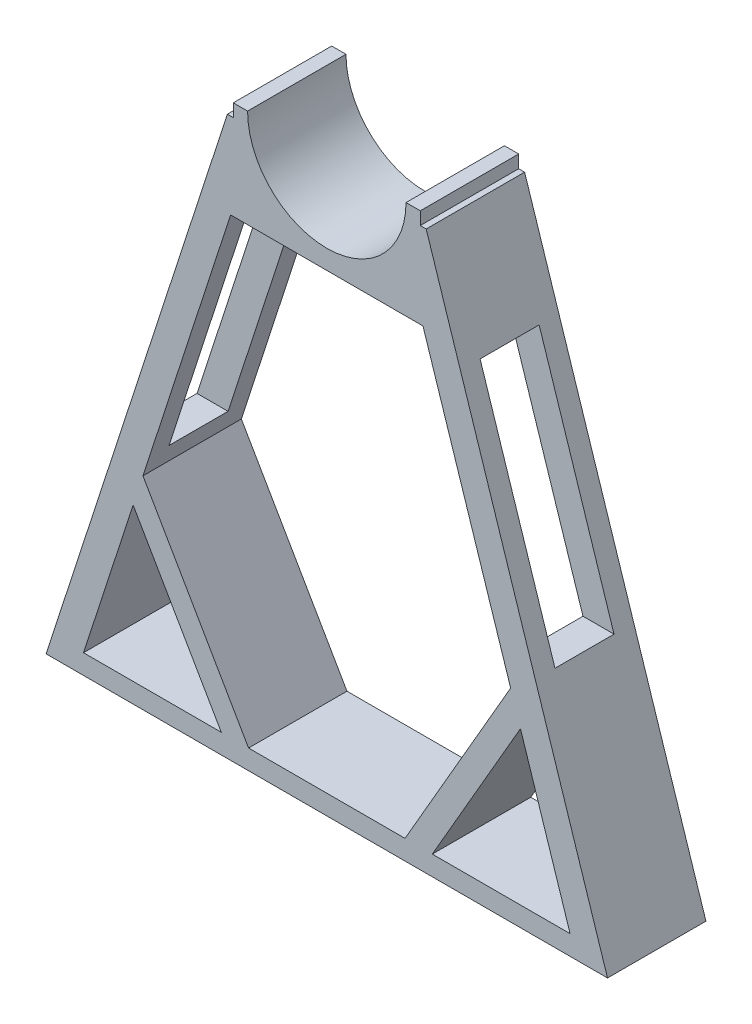
ISO-10303-21;
HEADER;
FILE_DESCRIPTION(('STEP AP214'),'2;1');
FILE_NAME('part.step','',(''),(''),'','','');
FILE_SCHEMA(('AUTOMOTIVE_DESIGN { 1 0 10303 214 1 1 1 1 }'));
ENDSEC;
DATA;
#1=APPLICATION_CONTEXT('core data for automotive mechanical design processes');
#2=APPLICATION_PROTOCOL_DEFINITION('international standard','automotive_design',2000,#1);
#3=PRODUCT_CONTEXT('',#1,'mechanical');
#4=PRODUCT('Part','Part','',(#3));
#5=PRODUCT_RELATED_PRODUCT_CATEGORY('part','',(#4));
#6=PRODUCT_DEFINITION_FORMATION('','',#4);
#7=PRODUCT_DEFINITION_CONTEXT('part definition',#1,'design');
#8=PRODUCT_DEFINITION('design','',#6,#7);
#9=PRODUCT_DEFINITION_SHAPE('','',#8);
#10=(LENGTH_UNIT() NAMED_UNIT(*) SI_UNIT(.MILLI.,.METRE.));
#11=(NAMED_UNIT(*) PLANE_ANGLE_UNIT() SI_UNIT($,.RADIAN.));
#12=(NAMED_UNIT(*) SI_UNIT($,.STERADIAN.) SOLID_ANGLE_UNIT());
#13=UNCERTAINTY_MEASURE_WITH_UNIT(LENGTH_MEASURE(1.E-05),#10,'distance_accuracy_value','');
#14=(GEOMETRIC_REPRESENTATION_CONTEXT(3) GLOBAL_UNCERTAINTY_ASSIGNED_CONTEXT((#13)) GLOBAL_UNIT_ASSIGNED_CONTEXT((#10,
#11,#12)) REPRESENTATION_CONTEXT('',''));
#15=CARTESIAN_POINT('',(0.,0.,0.));
#16=DIRECTION('',(0.,0.,1.));
#17=DIRECTION('',(1.,0.,0.));
#18=AXIS2_PLACEMENT_3D('',#15,#16,#17);
#19=CARTESIAN_POINT('',(142.624305452103,-290.,50.));
#20=DIRECTION('',(-0.951047079136985,-0.309046037452367,0.));
#21=DIRECTION('',(0.309046037452367,-0.951047079136985,0.));
#22=AXIS2_PLACEMENT_3D('',#19,#20,#21);
#23=PLANE('',#22);
#24=DIRECTION('',(-0.309046037452367,0.951047079136985,0.));
#25=VECTOR('',#24,1.);
#26=CARTESIAN_POINT('',(142.624305452103,-290.,0.));
#27=LINE('',#26,#25);
#28=CARTESIAN_POINT('',(142.624305452103,-290.,0.));
#29=VERTEX_POINT('',#28);
#30=CARTESIAN_POINT('',(50.5,-6.5,0.));
#31=VERTEX_POINT('',#30);
#32=EDGE_CURVE('E325',#29,#31,#27,.T.);
#33=ORIENTED_EDGE('',*,*,#32,.T.);
#34=DIRECTION('',(0.,0.,-1.));
#35=VECTOR('',#34,1.);
#36=CARTESIAN_POINT('',(50.5,-6.5,50.));
#37=LINE('',#36,#35);
#38=CARTESIAN_POINT('',(50.5,-6.5,50.));
#39=VERTEX_POINT('',#38);
#40=EDGE_CURVE('E398',#39,#31,#37,.T.);
#41=ORIENTED_EDGE('',*,*,#40,.F.);
#42=DIRECTION('',(-0.309046037452367,0.951047079136985,0.));
#43=VECTOR('',#42,1.);
#44=CARTESIAN_POINT('',(142.624305452103,-290.,50.));
#45=LINE('',#44,#43);
#46=CARTESIAN_POINT('',(142.624305452103,-290.,50.));
#47=VERTEX_POINT('',#46);
#48=EDGE_CURVE('E330',#47,#39,#45,.T.);
#49=ORIENTED_EDGE('',*,*,#48,.F.);
#50=DIRECTION('',(0.,0.,-1.));
#51=VECTOR('',#50,1.);
#52=CARTESIAN_POINT('',(142.624305452103,-290.,50.));
#53=LINE('',#52,#51);
#54=EDGE_CURVE('E352',#47,#29,#53,.T.);
#55=ORIENTED_EDGE('',*,*,#54,.T.);
#56=EDGE_LOOP('',(#33,#41,#49,#55));
#57=FACE_BOUND('',#56,.T.);
#58=DIRECTION('',(0.309046037452367,-0.951047079136985,0.));
#59=VECTOR('',#58,1.);
#60=CARTESIAN_POINT('',(142.624305452103,-290.,40.));
#61=LINE('',#60,#59);
#62=CARTESIAN_POINT('',(67.8850100235892,-60.,40.));
#63=VERTEX_POINT('',#62);
#64=CARTESIAN_POINT('',(105.925395084224,-177.064102809405,40.));
#65=VERTEX_POINT('',#64);
#66=EDGE_CURVE('E267',#63,#65,#61,.T.);
#67=ORIENTED_EDGE('',*,*,#66,.F.);
#68=DIRECTION('',(0.,0.,1.));
#69=VECTOR('',#68,1.);
#70=CARTESIAN_POINT('',(67.8850100235892,-60.,50.));
#71=LINE('',#70,#69);
#72=CARTESIAN_POINT('',(67.8850100235892,-60.,10.));
#73=VERTEX_POINT('',#72);
#74=EDGE_CURVE('E251',#73,#63,#71,.T.);
#75=ORIENTED_EDGE('',*,*,#74,.F.);
#76=DIRECTION('',(-0.309046037452367,0.951047079136985,0.));
#77=VECTOR('',#76,1.);
#78=CARTESIAN_POINT('',(142.624305452103,-290.,9.99999999999997));
#79=LINE('',#78,#77);
#80=CARTESIAN_POINT('',(105.925395084224,-177.064102809405,9.99999999999999));
#81=VERTEX_POINT('',#80);
#82=EDGE_CURVE('E242',#81,#73,#79,.T.);
#83=ORIENTED_EDGE('',*,*,#82,.F.);
#84=DIRECTION('',(0.,0.,-1.));
#85=VECTOR('',#84,1.);
#86=CARTESIAN_POINT('',(105.925395084224,-177.064102809405,50.));
#87=LINE('',#86,#85);
#88=EDGE_CURVE('E261',#65,#81,#87,.T.);
#89=ORIENTED_EDGE('',*,*,#88,.F.);
#90=EDGE_LOOP('',(#67,#75,#83,#89));
#91=FACE_BOUND('',#90,.T.);
#92=ADVANCED_FACE('F32',(#57,#91),#23,.F.);
#93=CARTESIAN_POINT('',(-50.5,-6.5,50.));
#94=DIRECTION('',(0.951047079136985,-0.309046037452367,0.));
#95=DIRECTION('',(0.309046037452367,0.951047079136985,0.));
#96=AXIS2_PLACEMENT_3D('',#93,#94,#95);
#97=PLANE('',#96);
#98=DIRECTION('',(-0.309046037452367,-0.951047079136985,0.));
#99=VECTOR('',#98,1.);
#100=CARTESIAN_POINT('',(-50.5,-6.5,0.));
#101=LINE('',#100,#99);
#102=CARTESIAN_POINT('',(-50.5,-6.5,0.));
#103=VERTEX_POINT('',#102);
#104=CARTESIAN_POINT('',(-142.624305452103,-290.,0.));
#105=VERTEX_POINT('',#104);
#106=EDGE_CURVE('E369',#103,#105,#101,.T.);
#107=ORIENTED_EDGE('',*,*,#106,.T.);
#108=DIRECTION('',(0.,0.,-1.));
#109=VECTOR('',#108,1.);
#110=CARTESIAN_POINT('',(-142.624305452103,-290.,50.));
#111=LINE('',#110,#109);
#112=CARTESIAN_POINT('',(-142.624305452103,-290.,50.));
#113=VERTEX_POINT('',#112);
#114=EDGE_CURVE('E374',#113,#105,#111,.T.);
#115=ORIENTED_EDGE('',*,*,#114,.F.);
#116=DIRECTION('',(-0.309046037452367,-0.951047079136985,0.));
#117=VECTOR('',#116,1.);
#118=CARTESIAN_POINT('',(-50.5,-6.5,50.));
#119=LINE('',#118,#117);
#120=CARTESIAN_POINT('',(-50.5,-6.5,50.));
#121=VERTEX_POINT('',#120);
#122=EDGE_CURVE('E348',#121,#113,#119,.T.);
#123=ORIENTED_EDGE('',*,*,#122,.F.);
#124=DIRECTION('',(0.,0.,-1.));
#125=VECTOR('',#124,1.);
#126=CARTESIAN_POINT('',(-50.5,-6.5,50.));
#127=LINE('',#126,#125);
#128=EDGE_CURVE('E377',#121,#103,#127,.T.);
#129=ORIENTED_EDGE('',*,*,#128,.T.);
#130=EDGE_LOOP('',(#107,#115,#123,#129));
#131=FACE_BOUND('',#130,.T.);
#132=DIRECTION('',(0.309046037452367,0.951047079136985,0.));
#133=VECTOR('',#132,1.);
#134=CARTESIAN_POINT('',(-50.5,-6.5,40.));
#135=LINE('',#134,#133);
#136=CARTESIAN_POINT('',(-105.925395084224,-177.064102809405,40.));
#137=VERTEX_POINT('',#136);
#138=CARTESIAN_POINT('',(-67.8850100235892,-60.,40.));
#139=VERTEX_POINT('',#138);
#140=EDGE_CURVE('E265',#137,#139,#135,.T.);
#141=ORIENTED_EDGE('',*,*,#140,.F.);
#142=DIRECTION('',(0.,0.,1.));
#143=VECTOR('',#142,1.);
#144=CARTESIAN_POINT('',(-105.925395084224,-177.064102809405,50.));
#145=LINE('',#144,#143);
#146=CARTESIAN_POINT('',(-105.925395084224,-177.064102809405,9.99999999999999));
#147=VERTEX_POINT('',#146);
#148=EDGE_CURVE('E259',#147,#137,#145,.T.);
#149=ORIENTED_EDGE('',*,*,#148,.F.);
#150=DIRECTION('',(-0.309046037452367,-0.951047079136985,0.));
#151=VECTOR('',#150,1.);
#152=CARTESIAN_POINT('',(-50.5,-6.5,10.));
#153=LINE('',#152,#151);
#154=CARTESIAN_POINT('',(-67.8850100235892,-60.,10.));
#155=VERTEX_POINT('',#154);
#156=EDGE_CURVE('E250',#155,#147,#153,.T.);
#157=ORIENTED_EDGE('',*,*,#156,.F.);
#158=DIRECTION('',(0.,0.,-1.));
#159=VECTOR('',#158,1.);
#160=CARTESIAN_POINT('',(-67.8850100235892,-60.,50.));
#161=LINE('',#160,#159);
#162=EDGE_CURVE('E233',#139,#155,#161,.T.);
#163=ORIENTED_EDGE('',*,*,#162,.F.);
#164=EDGE_LOOP('',(#141,#149,#157,#163));
#165=FACE_BOUND('',#164,.T.);
#166=ADVANCED_FACE('F469',(#131,#165),#97,.F.);
#167=CARTESIAN_POINT('',(48.8633855726318,-50.,-30.));
#168=DIRECTION('',(0.951047079136985,0.309046037452367,0.));
#169=DIRECTION('',(-0.309046037452367,0.951047079136985,0.));
#170=AXIS2_PLACEMENT_3D('',#167,#168,#169);
#171=PLANE('',#170);
#172=DIRECTION('',(0.,0.,1.));
#173=VECTOR('',#172,1.);
#174=CARTESIAN_POINT('',(93.4028398009638,-187.064102809405,-30.));
#175=LINE('',#174,#173);
#176=CARTESIAN_POINT('',(93.4028398009638,-187.064102809405,0.));
#177=VERTEX_POINT('',#176);
#178=CARTESIAN_POINT('',(93.4028398009638,-187.064102809405,50.));
#179=VERTEX_POINT('',#178);
#180=EDGE_CURVE('E305',#177,#179,#175,.T.);
#181=ORIENTED_EDGE('',*,*,#180,.T.);
#182=DIRECTION('',(-0.309046037452367,0.951047079136985,0.));
#183=VECTOR('',#182,1.);
#184=CARTESIAN_POINT('',(48.8633855726318,-50.,50.));
#185=LINE('',#184,#183);
#186=CARTESIAN_POINT('',(48.8633855726318,-50.,50.));
#187=VERTEX_POINT('',#186);
#188=EDGE_CURVE('E298',#179,#187,#185,.T.);
#189=ORIENTED_EDGE('',*,*,#188,.T.);
#190=DIRECTION('',(0.,0.,1.));
#191=VECTOR('',#190,1.);
#192=CARTESIAN_POINT('',(48.8633855726318,-50.,-30.));
#193=LINE('',#192,#191);
#194=CARTESIAN_POINT('',(48.8633855726318,-50.,0.));
#195=VERTEX_POINT('',#194);
#196=EDGE_CURVE('E302',#195,#187,#193,.T.);
#197=ORIENTED_EDGE('',*,*,#196,.F.);
#198=DIRECTION('',(-0.309046037452367,0.951047079136985,0.));
#199=VECTOR('',#198,1.);
#200=CARTESIAN_POINT('',(29.5006037700157,9.58632321950755,0.));
#201=LINE('',#200,#199);
#202=EDGE_CURVE('E431',#177,#195,#201,.T.);
#203=ORIENTED_EDGE('',*,*,#202,.F.);
#204=EDGE_LOOP('',(#181,#189,#197,#203));
#205=FACE_BOUND('',#204,.T.);
#206=DIRECTION('',(-0.309046037452367,0.951047079136985,0.));
#207=VECTOR('',#206,1.);
#208=CARTESIAN_POINT('',(48.8633855726318,-50.,40.));
#209=LINE('',#208,#207);
#210=CARTESIAN_POINT('',(90.1533052171153,-177.064102809405,40.));
#211=VERTEX_POINT('',#210);
#212=CARTESIAN_POINT('',(52.1129201564802,-60.,40.));
#213=VERTEX_POINT('',#212);
#214=EDGE_CURVE('E263',#211,#213,#209,.T.);
#215=ORIENTED_EDGE('',*,*,#214,.F.);
#216=DIRECTION('',(0.,0.,1.));
#217=VECTOR('',#216,1.);
#218=CARTESIAN_POINT('',(90.1533052171153,-177.064102809405,-30.));
#219=LINE('',#218,#217);
#220=CARTESIAN_POINT('',(90.1533052171153,-177.064102809405,9.99999999999998));
#221=VERTEX_POINT('',#220);
#222=EDGE_CURVE('E249',#221,#211,#219,.T.);
#223=ORIENTED_EDGE('',*,*,#222,.F.);
#224=DIRECTION('',(0.309046037452367,-0.951047079136985,0.));
#225=VECTOR('',#224,1.);
#226=CARTESIAN_POINT('',(48.8633855726318,-50.,10.));
#227=LINE('',#226,#225);
#228=CARTESIAN_POINT('',(52.1129201564802,-60.,10.));
#229=VERTEX_POINT('',#228);
#230=EDGE_CURVE('E239',#229,#221,#227,.T.);
#231=ORIENTED_EDGE('',*,*,#230,.F.);
#232=DIRECTION('',(0.,0.,-1.));
#233=VECTOR('',#232,1.);
#234=CARTESIAN_POINT('',(52.1129201564802,-60.,-30.));
#235=LINE('',#234,#233);
#236=EDGE_CURVE('E225',#213,#229,#235,.T.);
#237=ORIENTED_EDGE('',*,*,#236,.F.);
#238=EDGE_LOOP('',(#215,#223,#231,#237));
#239=FACE_BOUND('',#238,.T.);
#240=ADVANCED_FACE('F248',(#205,#239),#171,.F.);
#241=CARTESIAN_POINT('',(-93.4028398009641,-187.064102809406,-30.));
#242=DIRECTION('',(-0.951047079136985,0.309046037452368,0.));
#243=DIRECTION('',(-0.309046037452368,-0.951047079136985,0.));
#244=AXIS2_PLACEMENT_3D('',#241,#242,#243);
#245=PLANE('',#244);
#246=DIRECTION('',(0.,0.,1.));
#247=VECTOR('',#246,1.);
#248=CARTESIAN_POINT('',(-48.8633855726318,-50.,-30.));
#249=LINE('',#248,#247);
#250=CARTESIAN_POINT('',(-48.8633855726318,-50.,0.));
#251=VERTEX_POINT('',#250);
#252=CARTESIAN_POINT('',(-48.8633855726318,-50.,50.));
#253=VERTEX_POINT('',#252);
#254=EDGE_CURVE('E301',#251,#253,#249,.T.);
#255=ORIENTED_EDGE('',*,*,#254,.T.);
#256=DIRECTION('',(-0.309046037452368,-0.951047079136985,0.));
#257=VECTOR('',#256,1.);
#258=CARTESIAN_POINT('',(-93.4028398009641,-187.064102809406,50.));
#259=LINE('',#258,#257);
#260=CARTESIAN_POINT('',(-93.4028398009641,-187.064102809406,50.));
#261=VERTEX_POINT('',#260);
#262=EDGE_CURVE('E286',#253,#261,#259,.T.);
#263=ORIENTED_EDGE('',*,*,#262,.T.);
#264=DIRECTION('',(0.,0.,1.));
#265=VECTOR('',#264,1.);
#266=CARTESIAN_POINT('',(-93.4028398009641,-187.064102809406,-30.));
#267=LINE('',#266,#265);
#268=CARTESIAN_POINT('',(-93.4028398009641,-187.064102809406,0.));
#269=VERTEX_POINT('',#268);
#270=EDGE_CURVE('E311',#269,#261,#267,.T.);
#271=ORIENTED_EDGE('',*,*,#270,.F.);
#272=DIRECTION('',(-0.309046037452368,-0.951047079136985,0.));
#273=VECTOR('',#272,1.);
#274=CARTESIAN_POINT('',(-29.5006037700156,9.58632321950755,0.));
#275=LINE('',#274,#273);
#276=EDGE_CURVE('E419',#251,#269,#275,.T.);
#277=ORIENTED_EDGE('',*,*,#276,.F.);
#278=EDGE_LOOP('',(#255,#263,#271,#277));
#279=FACE_BOUND('',#278,.T.);
#280=DIRECTION('',(-0.309046037452368,-0.951047079136985,0.));
#281=VECTOR('',#280,1.);
#282=CARTESIAN_POINT('',(-93.4028398009641,-187.064102809406,40.));
#283=LINE('',#282,#281);
#284=CARTESIAN_POINT('',(-52.1129201564802,-60.,40.));
#285=VERTEX_POINT('',#284);
#286=CARTESIAN_POINT('',(-90.1533052171153,-177.064102809405,40.));
#287=VERTEX_POINT('',#286);
#288=EDGE_CURVE('E11',#285,#287,#283,.T.);
#289=ORIENTED_EDGE('',*,*,#288,.F.);
#290=DIRECTION('',(0.,0.,1.));
#291=VECTOR('',#290,1.);
#292=CARTESIAN_POINT('',(-52.1129201564802,-60.,-30.));
#293=LINE('',#292,#291);
#294=CARTESIAN_POINT('',(-52.1129201564802,-60.,10.));
#295=VERTEX_POINT('',#294);
#296=EDGE_CURVE('E437',#295,#285,#293,.T.);
#297=ORIENTED_EDGE('',*,*,#296,.F.);
#298=DIRECTION('',(0.309046037452368,0.951047079136985,0.));
#299=VECTOR('',#298,1.);
#300=CARTESIAN_POINT('',(-93.4028398009641,-187.064102809406,9.99999999999999));
#301=LINE('',#300,#299);
#302=CARTESIAN_POINT('',(-90.1533052171153,-177.064102809405,9.99999999999999));
#303=VERTEX_POINT('',#302);
#304=EDGE_CURVE('E439',#303,#295,#301,.T.);
#305=ORIENTED_EDGE('',*,*,#304,.F.);
#306=DIRECTION('',(0.,0.,-1.));
#307=VECTOR('',#306,1.);
#308=CARTESIAN_POINT('',(-90.1533052171153,-177.064102809405,-30.));
#309=LINE('',#308,#307);
#310=EDGE_CURVE('E39',#287,#303,#309,.T.);
#311=ORIENTED_EDGE('',*,*,#310,.F.);
#312=EDGE_LOOP('',(#289,#297,#305,#311));
#313=FACE_BOUND('',#312,.T.);
#314=ADVANCED_FACE('F460',(#279,#313),#245,.F.);
#315=CARTESIAN_POINT('',(47.5,-6.5,50.));
#316=DIRECTION('',(0.,-1.,0.));
#317=DIRECTION('',(0.,0.,-1.));
#318=AXIS2_PLACEMENT_3D('',#315,#316,#317);
#319=PLANE('',#318);
#320=DIRECTION('',(-1.,0.,0.));
#321=VECTOR('',#320,1.);
#322=CARTESIAN_POINT('',(47.5,-6.5,0.));
#323=LINE('',#322,#321);
#324=CARTESIAN_POINT('',(47.5,-6.5,0.));
#325=VERTEX_POINT('',#324);
#326=EDGE_CURVE('E355',#31,#325,#323,.T.);
#327=ORIENTED_EDGE('',*,*,#326,.T.);
#328=DIRECTION('',(0.,0.,-1.));
#329=VECTOR('',#328,1.);
#330=CARTESIAN_POINT('',(47.5,-6.5,50.));
#331=LINE('',#330,#329);
#332=CARTESIAN_POINT('',(47.5,-6.5,50.));
#333=VERTEX_POINT('',#332);
#334=EDGE_CURVE('E395',#333,#325,#331,.T.);
#335=ORIENTED_EDGE('',*,*,#334,.F.);
#336=DIRECTION('',(-1.,0.,0.));
#337=VECTOR('',#336,1.);
#338=CARTESIAN_POINT('',(47.5,-6.5,50.));
#339=LINE('',#338,#337);
#340=EDGE_CURVE('E333',#39,#333,#339,.T.);
#341=ORIENTED_EDGE('',*,*,#340,.F.);
#342=ORIENTED_EDGE('',*,*,#40,.T.);
#343=EDGE_LOOP('',(#327,#335,#341,#342));
#344=FACE_BOUND('',#343,.T.);
#345=ADVANCED_FACE('F506',(#344),#319,.F.);
#346=CARTESIAN_POINT('',(47.5,0.,50.));
#347=DIRECTION('',(-1.,0.,0.));
#348=DIRECTION('',(0.,0.,1.));
#349=AXIS2_PLACEMENT_3D('',#346,#347,#348);
#350=PLANE('',#349);
#351=DIRECTION('',(0.,1.,0.));
#352=VECTOR('',#351,1.);
#353=CARTESIAN_POINT('',(47.5,0.,0.));
#354=LINE('',#353,#352);
#355=CARTESIAN_POINT('',(47.5,0.,0.));
#356=VERTEX_POINT('',#355);
#357=EDGE_CURVE('E357',#325,#356,#354,.T.);
#358=ORIENTED_EDGE('',*,*,#357,.T.);
#359=DIRECTION('',(0.,0.,-1.));
#360=VECTOR('',#359,1.);
#361=CARTESIAN_POINT('',(47.5,0.,50.));
#362=LINE('',#361,#360);
#363=CARTESIAN_POINT('',(47.5,0.,50.));
#364=VERTEX_POINT('',#363);
#365=EDGE_CURVE('E392',#364,#356,#362,.T.);
#366=ORIENTED_EDGE('',*,*,#365,.F.);
#367=DIRECTION('',(0.,1.,0.));
#368=VECTOR('',#367,1.);
#369=CARTESIAN_POINT('',(47.5,0.,50.));
#370=LINE('',#369,#368);
#371=EDGE_CURVE('E336',#333,#364,#370,.T.);
#372=ORIENTED_EDGE('',*,*,#371,.F.);
#373=ORIENTED_EDGE('',*,*,#334,.T.);
#374=EDGE_LOOP('',(#358,#366,#372,#373));
#375=FACE_BOUND('',#374,.T.);
#376=ADVANCED_FACE('F503',(#375),#350,.F.);
#377=CARTESIAN_POINT('',(40.25,0.,50.));
#378=DIRECTION('',(0.,-1.,0.));
#379=DIRECTION('',(1.,0.,0.));
#380=AXIS2_PLACEMENT_3D('',#377,#378,#379);
#381=PLANE('',#380);
#382=DIRECTION('',(-1.,0.,0.));
#383=VECTOR('',#382,1.);
#384=CARTESIAN_POINT('',(40.25,0.,0.));
#385=LINE('',#384,#383);
#386=CARTESIAN_POINT('',(40.25,0.,0.));
#387=VERTEX_POINT('',#386);
#388=EDGE_CURVE('E359',#356,#387,#385,.T.);
#389=ORIENTED_EDGE('',*,*,#388,.T.);
#390=DIRECTION('',(0.,0.,-1.));
#391=VECTOR('',#390,1.);
#392=CARTESIAN_POINT('',(40.25,0.,50.));
#393=LINE('',#392,#391);
#394=CARTESIAN_POINT('',(40.25,0.,50.));
#395=VERTEX_POINT('',#394);
#396=EDGE_CURVE('E389',#395,#387,#393,.T.);
#397=ORIENTED_EDGE('',*,*,#396,.F.);
#398=DIRECTION('',(-1.,0.,0.));
#399=VECTOR('',#398,1.);
#400=CARTESIAN_POINT('',(40.25,0.,50.));
#401=LINE('',#400,#399);
#402=EDGE_CURVE('E338',#364,#395,#401,.T.);
#403=ORIENTED_EDGE('',*,*,#402,.F.);
#404=ORIENTED_EDGE('',*,*,#365,.T.);
#405=EDGE_LOOP('',(#389,#397,#403,#404));
#406=FACE_BOUND('',#405,.T.);
#407=ADVANCED_FACE('F499',(#406),#381,.F.);
#408=CARTESIAN_POINT('',(0.,0.,50.));
#409=DIRECTION('',(0.,0.,-1.));
#410=DIRECTION('',(-1.,0.,0.));
#411=AXIS2_PLACEMENT_3D('',#408,#409,#410);
#412=CYLINDRICAL_SURFACE('',#411,40.25);
#413=CARTESIAN_POINT('',(0.,0.,0.));
#414=DIRECTION('',(0.,0.,-1.));
#415=DIRECTION('',(1.,0.,0.));
#416=AXIS2_PLACEMENT_3D('',#413,#414,#415);
#417=CIRCLE('',#416,40.25);
#418=CARTESIAN_POINT('',(-40.25,0.,0.));
#419=VERTEX_POINT('',#418);
#420=EDGE_CURVE('E361',#387,#419,#417,.T.);
#421=ORIENTED_EDGE('',*,*,#420,.T.);
#422=DIRECTION('',(0.,0.,-1.));
#423=VECTOR('',#422,1.);
#424=CARTESIAN_POINT('',(-40.25,0.,50.));
#425=LINE('',#424,#423);
#426=CARTESIAN_POINT('',(-40.25,0.,50.));
#427=VERTEX_POINT('',#426);
#428=EDGE_CURVE('E386',#427,#419,#425,.T.);
#429=ORIENTED_EDGE('',*,*,#428,.F.);
#430=CARTESIAN_POINT('',(0.,0.,50.));
#431=DIRECTION('',(0.,0.,-1.));
#432=DIRECTION('',(1.,0.,0.));
#433=AXIS2_PLACEMENT_3D('',#430,#431,#432);
#434=CIRCLE('',#433,40.25);
#435=EDGE_CURVE('E340',#395,#427,#434,.T.);
#436=ORIENTED_EDGE('',*,*,#435,.F.);
#437=ORIENTED_EDGE('',*,*,#396,.T.);
#438=EDGE_LOOP('',(#421,#429,#436,#437));
#439=FACE_BOUND('',#438,.T.);
#440=ADVANCED_FACE('F495',(#439),#412,.F.);
#441=CARTESIAN_POINT('',(-40.25,0.,50.));
#442=DIRECTION('',(0.,-1.,0.));
#443=DIRECTION('',(1.,0.,0.));
#444=AXIS2_PLACEMENT_3D('',#441,#442,#443);
#445=PLANE('',#444);
#446=DIRECTION('',(-1.,0.,0.));
#447=VECTOR('',#446,1.);
#448=CARTESIAN_POINT('',(-40.25,0.,0.));
#449=LINE('',#448,#447);
#450=CARTESIAN_POINT('',(-47.5,0.,0.));
#451=VERTEX_POINT('',#450);
#452=EDGE_CURVE('E363',#419,#451,#449,.T.);
#453=ORIENTED_EDGE('',*,*,#452,.T.);
#454=DIRECTION('',(0.,0.,-1.));
#455=VECTOR('',#454,1.);
#456=CARTESIAN_POINT('',(-47.5,0.,50.));
#457=LINE('',#456,#455);
#458=CARTESIAN_POINT('',(-47.5,0.,50.));
#459=VERTEX_POINT('',#458);
#460=EDGE_CURVE('E383',#459,#451,#457,.T.);
#461=ORIENTED_EDGE('',*,*,#460,.F.);
#462=DIRECTION('',(-1.,0.,0.));
#463=VECTOR('',#462,1.);
#464=CARTESIAN_POINT('',(-40.25,0.,50.));
#465=LINE('',#464,#463);
#466=EDGE_CURVE('E342',#427,#459,#465,.T.);
#467=ORIENTED_EDGE('',*,*,#466,.F.);
#468=ORIENTED_EDGE('',*,*,#428,.T.);
#469=EDGE_LOOP('',(#453,#461,#467,#468));
#470=FACE_BOUND('',#469,.T.);
#471=ADVANCED_FACE('F491',(#470),#445,.F.);
#472=CARTESIAN_POINT('',(-47.5,0.,50.));
#473=DIRECTION('',(1.,0.,0.));
#474=DIRECTION('',(0.,0.,-1.));
#475=AXIS2_PLACEMENT_3D('',#472,#473,#474);
#476=PLANE('',#475);
#477=DIRECTION('',(0.,-1.,0.));
#478=VECTOR('',#477,1.);
#479=CARTESIAN_POINT('',(-47.5,0.,0.));
#480=LINE('',#479,#478);
#481=CARTESIAN_POINT('',(-47.5,-6.5,0.));
#482=VERTEX_POINT('',#481);
#483=EDGE_CURVE('E365',#451,#482,#480,.T.);
#484=ORIENTED_EDGE('',*,*,#483,.T.);
#485=DIRECTION('',(0.,0.,-1.));
#486=VECTOR('',#485,1.);
#487=CARTESIAN_POINT('',(-47.5,-6.5,50.));
#488=LINE('',#487,#486);
#489=CARTESIAN_POINT('',(-47.5,-6.5,50.));
#490=VERTEX_POINT('',#489);
#491=EDGE_CURVE('E380',#490,#482,#488,.T.);
#492=ORIENTED_EDGE('',*,*,#491,.F.);
#493=DIRECTION('',(0.,-1.,0.));
#494=VECTOR('',#493,1.);
#495=CARTESIAN_POINT('',(-47.5,0.,50.));
#496=LINE('',#495,#494);
#497=EDGE_CURVE('E344',#459,#490,#496,.T.);
#498=ORIENTED_EDGE('',*,*,#497,.F.);
#499=ORIENTED_EDGE('',*,*,#460,.T.);
#500=EDGE_LOOP('',(#484,#492,#498,#499));
#501=FACE_BOUND('',#500,.T.);
#502=ADVANCED_FACE('F487',(#501),#476,.F.);
#503=CARTESIAN_POINT('',(-47.5,-6.5,50.));
#504=DIRECTION('',(0.,-1.,0.));
#505=DIRECTION('',(0.,0.,-1.));
#506=AXIS2_PLACEMENT_3D('',#503,#504,#505);
#507=PLANE('',#506);
#508=DIRECTION('',(-1.,0.,0.));
#509=VECTOR('',#508,1.);
#510=CARTESIAN_POINT('',(-47.5,-6.5,0.));
#511=LINE('',#510,#509);
#512=EDGE_CURVE('E367',#482,#103,#511,.T.);
#513=ORIENTED_EDGE('',*,*,#512,.T.);
#514=ORIENTED_EDGE('',*,*,#128,.F.);
#515=DIRECTION('',(-1.,0.,0.));
#516=VECTOR('',#515,1.);
#517=CARTESIAN_POINT('',(-47.5,-6.5,50.));
#518=LINE('',#517,#516);
#519=EDGE_CURVE('E346',#490,#121,#518,.T.);
#520=ORIENTED_EDGE('',*,*,#519,.F.);
#521=ORIENTED_EDGE('',*,*,#491,.T.);
#522=EDGE_LOOP('',(#513,#514,#520,#521));
#523=FACE_BOUND('',#522,.T.);
#524=ADVANCED_FACE('F484',(#523),#507,.F.);
#525=CARTESIAN_POINT('',(-142.624305452103,-290.,50.));
#526=DIRECTION('',(0.,1.,0.));
#527=DIRECTION('',(0.,0.,1.));
#528=AXIS2_PLACEMENT_3D('',#525,#526,#527);
#529=PLANE('',#528);
#530=DIRECTION('',(1.,0.,0.));
#531=VECTOR('',#530,1.);
#532=CARTESIAN_POINT('',(-142.624305452103,-290.,0.));
#533=LINE('',#532,#531);
#534=EDGE_CURVE('E334',#105,#29,#533,.T.);
#535=ORIENTED_EDGE('',*,*,#534,.T.);
#536=ORIENTED_EDGE('',*,*,#54,.F.);
#537=DIRECTION('',(1.,0.,0.));
#538=VECTOR('',#537,1.);
#539=CARTESIAN_POINT('',(-142.624305452103,-290.,50.));
#540=LINE('',#539,#538);
#541=EDGE_CURVE('E350',#113,#47,#540,.T.);
#542=ORIENTED_EDGE('',*,*,#541,.F.);
#543=ORIENTED_EDGE('',*,*,#114,.T.);
#544=EDGE_LOOP('',(#535,#536,#542,#543));
#545=FACE_BOUND('',#544,.T.);
#546=ADVANCED_FACE('F482',(#545),#529,.F.);
#547=CARTESIAN_POINT('',(0.,0.,50.));
#548=DIRECTION('',(0.,0.,1.));
#549=DIRECTION('',(1.,0.,0.));
#550=AXIS2_PLACEMENT_3D('',#547,#548,#549);
#551=PLANE('',#550);
#552=DIRECTION('',(-1.,0.,0.));
#553=VECTOR('',#552,1.);
#554=CARTESIAN_POINT('',(48.8633855726318,-50.,50.));
#555=LINE('',#554,#553);
#556=EDGE_CURVE('E280',#187,#253,#555,.T.);
#557=ORIENTED_EDGE('',*,*,#556,.F.);
#558=ORIENTED_EDGE('',*,*,#188,.F.);
#559=DIRECTION('',(0.499999999999998,0.86602540378444,0.));
#560=VECTOR('',#559,1.);
#561=CARTESIAN_POINT('',(93.4028398009638,-187.064102809405,50.));
#562=LINE('',#561,#560);
#563=CARTESIAN_POINT('',(39.7462745405948,-280.,50.));
#564=VERTEX_POINT('',#563);
#565=EDGE_CURVE('E295',#564,#179,#562,.T.);
#566=ORIENTED_EDGE('',*,*,#565,.F.);
#567=DIRECTION('',(1.,0.,0.));
#568=VECTOR('',#567,1.);
#569=CARTESIAN_POINT('',(39.7462745405948,-280.,50.));
#570=LINE('',#569,#568);
#571=CARTESIAN_POINT('',(-39.7462745405948,-280.,50.));
#572=VERTEX_POINT('',#571);
#573=EDGE_CURVE('E292',#572,#564,#570,.T.);
#574=ORIENTED_EDGE('',*,*,#573,.F.);
#575=DIRECTION('',(0.500000000000004,-0.866025403784436,0.));
#576=VECTOR('',#575,1.);
#577=CARTESIAN_POINT('',(-93.4028398009641,-187.064102809406,50.));
#578=LINE('',#577,#576);
#579=EDGE_CURVE('E289',#261,#572,#578,.T.);
#580=ORIENTED_EDGE('',*,*,#579,.F.);
#581=ORIENTED_EDGE('',*,*,#262,.F.);
#582=EDGE_LOOP('',(#557,#558,#566,#574,#580,#581));
#583=FACE_BOUND('',#582,.T.);
#584=DIRECTION('',(-0.309046037452368,0.951047079136985,0.));
#585=VECTOR('',#584,1.);
#586=CARTESIAN_POINT('',(98.3930521458092,-202.420801487576,50.));
#587=LINE('',#586,#585);
#588=CARTESIAN_POINT('',(123.602681001146,-280.,50.));
#589=VERTEX_POINT('',#588);
#590=CARTESIAN_POINT('',(98.3930521458092,-202.420801487576,50.));
#591=VERTEX_POINT('',#590);
#592=EDGE_CURVE('E269',#589,#591,#587,.T.);
#593=ORIENTED_EDGE('',*,*,#592,.F.);
#594=DIRECTION('',(1.,0.,0.));
#595=VECTOR('',#594,1.);
#596=CARTESIAN_POINT('',(123.602681001146,-280.,50.));
#597=LINE('',#596,#595);
#598=CARTESIAN_POINT('',(53.6026810011458,-280.,50.));
#599=VERTEX_POINT('',#598);
#600=EDGE_CURVE('E274',#599,#589,#597,.T.);
#601=ORIENTED_EDGE('',*,*,#600,.F.);
#602=DIRECTION('',(-0.499999999999998,-0.86602540378444,0.));
#603=VECTOR('',#602,1.);
#604=CARTESIAN_POINT('',(98.3930521458092,-202.420801487576,50.));
#605=LINE('',#604,#603);
#606=EDGE_CURVE('E271',#591,#599,#605,.T.);
#607=ORIENTED_EDGE('',*,*,#606,.F.);
#608=EDGE_LOOP('',(#593,#601,#607));
#609=FACE_BOUND('',#608,.T.);
#610=DIRECTION('',(1.,0.,0.));
#611=VECTOR('',#610,1.);
#612=CARTESIAN_POINT('',(-53.6026810011458,-280.,50.));
#613=LINE('',#612,#611);
#614=CARTESIAN_POINT('',(-123.602681001146,-280.,50.));
#615=VERTEX_POINT('',#614);
#616=CARTESIAN_POINT('',(-53.6026810011459,-280.,50.));
#617=VERTEX_POINT('',#616);
#618=EDGE_CURVE('E304',#615,#617,#613,.T.);
#619=ORIENTED_EDGE('',*,*,#618,.F.);
#620=DIRECTION('',(-0.309046037452367,-0.951047079136985,0.));
#621=VECTOR('',#620,1.);
#622=CARTESIAN_POINT('',(-123.602681001146,-280.,50.));
#623=LINE('',#622,#621);
#624=CARTESIAN_POINT('',(-98.3930521458095,-202.420801487576,50.));
#625=VERTEX_POINT('',#624);
#626=EDGE_CURVE('E319',#625,#615,#623,.T.);
#627=ORIENTED_EDGE('',*,*,#626,.F.);
#628=DIRECTION('',(-0.500000000000005,0.866025403784436,0.));
#629=VECTOR('',#628,1.);
#630=CARTESIAN_POINT('',(-98.3930521458095,-202.420801487576,50.));
#631=LINE('',#630,#629);
#632=EDGE_CURVE('E316',#617,#625,#631,.T.);
#633=ORIENTED_EDGE('',*,*,#632,.F.);
#634=EDGE_LOOP('',(#619,#627,#633));
#635=FACE_BOUND('',#634,.T.);
#636=ORIENTED_EDGE('',*,*,#48,.T.);
#637=ORIENTED_EDGE('',*,*,#340,.T.);
#638=ORIENTED_EDGE('',*,*,#371,.T.);
#639=ORIENTED_EDGE('',*,*,#402,.T.);
#640=ORIENTED_EDGE('',*,*,#435,.T.);
#641=ORIENTED_EDGE('',*,*,#466,.T.);
#642=ORIENTED_EDGE('',*,*,#497,.T.);
#643=ORIENTED_EDGE('',*,*,#519,.T.);
#644=ORIENTED_EDGE('',*,*,#122,.T.);
#645=ORIENTED_EDGE('',*,*,#541,.T.);
#646=EDGE_LOOP('',(#636,#637,#638,#639,#640,#641,#642,#643,#644,#645));
#647=FACE_BOUND('',#646,.T.);
#648=ADVANCED_FACE('F532',(#583,#609,#635,#647),#551,.T.);
#649=CARTESIAN_POINT('',(0.,0.,0.));
#650=DIRECTION('',(0.,0.,1.));
#651=DIRECTION('',(1.,0.,0.));
#652=AXIS2_PLACEMENT_3D('',#649,#650,#651);
#653=PLANE('',#652);
#654=ORIENTED_EDGE('',*,*,#202,.T.);
#655=DIRECTION('',(-1.,0.,0.));
#656=VECTOR('',#655,1.);
#657=CARTESIAN_POINT('',(0.,-50.,0.));
#658=LINE('',#657,#656);
#659=EDGE_CURVE('E434',#195,#251,#658,.T.);
#660=ORIENTED_EDGE('',*,*,#659,.T.);
#661=ORIENTED_EDGE('',*,*,#276,.T.);
#662=DIRECTION('',(0.500000000000004,-0.866025403784436,0.));
#663=VECTOR('',#662,1.);
#664=CARTESIAN_POINT('',(-151.053262435268,-87.2106417289742,0.));
#665=LINE('',#664,#663);
#666=CARTESIAN_POINT('',(-39.7462745405948,-280.,0.));
#667=VERTEX_POINT('',#666);
#668=EDGE_CURVE('E422',#269,#667,#665,.T.);
#669=ORIENTED_EDGE('',*,*,#668,.T.);
#670=DIRECTION('',(1.,0.,0.));
#671=VECTOR('',#670,1.);
#672=CARTESIAN_POINT('',(0.,-280.,0.));
#673=LINE('',#672,#671);
#674=CARTESIAN_POINT('',(39.7462745405948,-280.,0.));
#675=VERTEX_POINT('',#674);
#676=EDGE_CURVE('E425',#667,#675,#673,.T.);
#677=ORIENTED_EDGE('',*,*,#676,.T.);
#678=DIRECTION('',(0.499999999999998,0.86602540378444,0.));
#679=VECTOR('',#678,1.);
#680=CARTESIAN_POINT('',(151.053262435267,-87.2106417289722,0.));
#681=LINE('',#680,#679);
#682=EDGE_CURVE('E428',#675,#177,#681,.T.);
#683=ORIENTED_EDGE('',*,*,#682,.T.);
#684=EDGE_LOOP('',(#654,#660,#661,#669,#677,#683));
#685=FACE_BOUND('',#684,.T.);
#686=DIRECTION('',(1.,0.,0.));
#687=VECTOR('',#686,1.);
#688=CARTESIAN_POINT('',(2.22044604925031E-13,-280.,0.));
#689=LINE('',#688,#687);
#690=CARTESIAN_POINT('',(53.6026810011458,-280.,0.));
#691=VERTEX_POINT('',#690);
#692=CARTESIAN_POINT('',(123.602681001146,-280.,0.));
#693=VERTEX_POINT('',#692);
#694=EDGE_CURVE('E413',#691,#693,#689,.T.);
#695=ORIENTED_EDGE('',*,*,#694,.T.);
#696=DIRECTION('',(-0.309046037452368,0.951047079136985,0.));
#697=VECTOR('',#696,1.);
#698=CARTESIAN_POINT('',(29.5006037700156,9.58632321950755,0.));
#699=LINE('',#698,#697);
#700=CARTESIAN_POINT('',(98.3930521458092,-202.420801487576,0.));
#701=VERTEX_POINT('',#700);
#702=EDGE_CURVE('E416',#693,#701,#699,.T.);
#703=ORIENTED_EDGE('',*,*,#702,.T.);
#704=DIRECTION('',(-0.499999999999998,-0.86602540378444,0.));
#705=VECTOR('',#704,1.);
#706=CARTESIAN_POINT('',(161.445567280681,-93.2106417289721,0.));
#707=LINE('',#706,#705);
#708=EDGE_CURVE('E410',#701,#691,#707,.T.);
#709=ORIENTED_EDGE('',*,*,#708,.T.);
#710=EDGE_LOOP('',(#695,#703,#709));
#711=FACE_BOUND('',#710,.T.);
#712=DIRECTION('',(-0.309046037452367,-0.951047079136985,0.));
#713=VECTOR('',#712,1.);
#714=CARTESIAN_POINT('',(-29.5006037700158,9.58632321950758,0.));
#715=LINE('',#714,#713);
#716=CARTESIAN_POINT('',(-98.3930521458095,-202.420801487577,0.));
#717=VERTEX_POINT('',#716);
#718=CARTESIAN_POINT('',(-123.602681001146,-280.,0.));
#719=VERTEX_POINT('',#718);
#720=EDGE_CURVE('E404',#717,#719,#715,.T.);
#721=ORIENTED_EDGE('',*,*,#720,.T.);
#722=DIRECTION('',(1.,0.,0.));
#723=VECTOR('',#722,1.);
#724=CARTESIAN_POINT('',(2.22044604925031E-13,-280.,0.));
#725=LINE('',#724,#723);
#726=CARTESIAN_POINT('',(-53.6026810011458,-280.,0.));
#727=VERTEX_POINT('',#726);
#728=EDGE_CURVE('E407',#719,#727,#725,.T.);
#729=ORIENTED_EDGE('',*,*,#728,.T.);
#730=DIRECTION('',(-0.500000000000005,0.866025403784436,0.));
#731=VECTOR('',#730,1.);
#732=CARTESIAN_POINT('',(-161.445567280681,-93.2106417289744,0.));
#733=LINE('',#732,#731);
#734=EDGE_CURVE('E401',#727,#717,#733,.T.);
#735=ORIENTED_EDGE('',*,*,#734,.T.);
#736=EDGE_LOOP('',(#721,#729,#735));
#737=FACE_BOUND('',#736,.T.);
#738=ORIENTED_EDGE('',*,*,#32,.F.);
#739=ORIENTED_EDGE('',*,*,#534,.F.);
#740=ORIENTED_EDGE('',*,*,#106,.F.);
#741=ORIENTED_EDGE('',*,*,#512,.F.);
#742=ORIENTED_EDGE('',*,*,#483,.F.);
#743=ORIENTED_EDGE('',*,*,#452,.F.);
#744=ORIENTED_EDGE('',*,*,#420,.F.);
#745=ORIENTED_EDGE('',*,*,#388,.F.);
#746=ORIENTED_EDGE('',*,*,#357,.F.);
#747=ORIENTED_EDGE('',*,*,#326,.F.);
#748=EDGE_LOOP('',(#738,#739,#740,#741,#742,#743,#744,#745,#746,#747));
#749=FACE_BOUND('',#748,.T.);
#750=ADVANCED_FACE('F523',(#685,#711,#737,#749),#653,.F.);
#751=CARTESIAN_POINT('',(-53.6026810011458,-280.,-30.));
#752=DIRECTION('',(0.,-1.,0.));
#753=DIRECTION('',(1.,0.,0.));
#754=AXIS2_PLACEMENT_3D('',#751,#752,#753);
#755=PLANE('',#754);
#756=DIRECTION('',(0.,0.,1.));
#757=VECTOR('',#756,1.);
#758=CARTESIAN_POINT('',(-123.602681001146,-280.,-30.));
#759=LINE('',#758,#757);
#760=EDGE_CURVE('E323',#719,#615,#759,.T.);
#761=ORIENTED_EDGE('',*,*,#760,.T.);
#762=ORIENTED_EDGE('',*,*,#618,.T.);
#763=DIRECTION('',(0.,0.,1.));
#764=VECTOR('',#763,1.);
#765=CARTESIAN_POINT('',(-53.6026810011458,-280.,-30.));
#766=LINE('',#765,#764);
#767=EDGE_CURVE('E322',#727,#617,#766,.T.);
#768=ORIENTED_EDGE('',*,*,#767,.F.);
#769=ORIENTED_EDGE('',*,*,#728,.F.);
#770=EDGE_LOOP('',(#761,#762,#768,#769));
#771=FACE_BOUND('',#770,.T.);
#772=ADVANCED_FACE('F558',(#771),#755,.F.);
#773=CARTESIAN_POINT('',(-123.602681001146,-280.,-30.));
#774=DIRECTION('',(-0.951047079136985,0.309046037452367,0.));
#775=DIRECTION('',(-0.309046037452367,-0.951047079136985,0.));
#776=AXIS2_PLACEMENT_3D('',#773,#774,#775);
#777=PLANE('',#776);
#778=DIRECTION('',(0.,0.,1.));
#779=VECTOR('',#778,1.);
#780=CARTESIAN_POINT('',(-98.3930521458095,-202.420801487576,-30.));
#781=LINE('',#780,#779);
#782=EDGE_CURVE('E326',#717,#625,#781,.T.);
#783=ORIENTED_EDGE('',*,*,#782,.T.);
#784=ORIENTED_EDGE('',*,*,#626,.T.);
#785=ORIENTED_EDGE('',*,*,#760,.F.);
#786=ORIENTED_EDGE('',*,*,#720,.F.);
#787=EDGE_LOOP('',(#783,#784,#785,#786));
#788=FACE_BOUND('',#787,.T.);
#789=ADVANCED_FACE('F565',(#788),#777,.F.);
#790=CARTESIAN_POINT('',(-98.3930521458095,-202.420801487576,-30.));
#791=DIRECTION('',(0.866025403784436,0.500000000000005,0.));
#792=DIRECTION('',(-0.500000000000005,0.866025403784436,0.));
#793=AXIS2_PLACEMENT_3D('',#790,#791,#792);
#794=PLANE('',#793);
#795=ORIENTED_EDGE('',*,*,#767,.T.);
#796=ORIENTED_EDGE('',*,*,#632,.T.);
#797=ORIENTED_EDGE('',*,*,#782,.F.);
#798=ORIENTED_EDGE('',*,*,#734,.F.);
#799=EDGE_LOOP('',(#795,#796,#797,#798));
#800=FACE_BOUND('',#799,.T.);
#801=ADVANCED_FACE('F567',(#800),#794,.F.);
#802=CARTESIAN_POINT('',(98.3930521458092,-202.420801487576,-30.));
#803=DIRECTION('',(0.951047079136985,0.309046037452368,0.));
#804=DIRECTION('',(-0.309046037452368,0.951047079136985,0.));
#805=AXIS2_PLACEMENT_3D('',#802,#803,#804);
#806=PLANE('',#805);
#807=DIRECTION('',(0.,0.,1.));
#808=VECTOR('',#807,1.);
#809=CARTESIAN_POINT('',(123.602681001146,-280.,-30.));
#810=LINE('',#809,#808);
#811=EDGE_CURVE('E278',#693,#589,#810,.T.);
#812=ORIENTED_EDGE('',*,*,#811,.T.);
#813=ORIENTED_EDGE('',*,*,#592,.T.);
#814=DIRECTION('',(0.,0.,1.));
#815=VECTOR('',#814,1.);
#816=CARTESIAN_POINT('',(98.3930521458092,-202.420801487576,-30.));
#817=LINE('',#816,#815);
#818=EDGE_CURVE('E277',#701,#591,#817,.T.);
#819=ORIENTED_EDGE('',*,*,#818,.F.);
#820=ORIENTED_EDGE('',*,*,#702,.F.);
#821=EDGE_LOOP('',(#812,#813,#819,#820));
#822=FACE_BOUND('',#821,.T.);
#823=ADVANCED_FACE('F570',(#822),#806,.F.);
#824=CARTESIAN_POINT('',(123.602681001146,-280.,-30.));
#825=DIRECTION('',(0.,-1.,0.));
#826=DIRECTION('',(1.,0.,0.));
#827=AXIS2_PLACEMENT_3D('',#824,#825,#826);
#828=PLANE('',#827);
#829=DIRECTION('',(0.,0.,1.));
#830=VECTOR('',#829,1.);
#831=CARTESIAN_POINT('',(53.6026810011458,-280.,-30.));
#832=LINE('',#831,#830);
#833=EDGE_CURVE('E281',#691,#599,#832,.T.);
#834=ORIENTED_EDGE('',*,*,#833,.T.);
#835=ORIENTED_EDGE('',*,*,#600,.T.);
#836=ORIENTED_EDGE('',*,*,#811,.F.);
#837=ORIENTED_EDGE('',*,*,#694,.F.);
#838=EDGE_LOOP('',(#834,#835,#836,#837));
#839=FACE_BOUND('',#838,.T.);
#840=ADVANCED_FACE('F594',(#839),#828,.F.);
#841=CARTESIAN_POINT('',(98.3930521458092,-202.420801487576,-30.));
#842=DIRECTION('',(-0.86602540378444,0.499999999999998,0.));
#843=DIRECTION('',(-0.499999999999998,-0.86602540378444,0.));
#844=AXIS2_PLACEMENT_3D('',#841,#842,#843);
#845=PLANE('',#844);
#846=ORIENTED_EDGE('',*,*,#818,.T.);
#847=ORIENTED_EDGE('',*,*,#606,.T.);
#848=ORIENTED_EDGE('',*,*,#833,.F.);
#849=ORIENTED_EDGE('',*,*,#708,.F.);
#850=EDGE_LOOP('',(#846,#847,#848,#849));
#851=FACE_BOUND('',#850,.T.);
#852=ADVANCED_FACE('F578',(#851),#845,.F.);
#853=CARTESIAN_POINT('',(48.8633855726318,-50.,-30.));
#854=DIRECTION('',(0.,1.,0.));
#855=DIRECTION('',(-1.,0.,0.));
#856=AXIS2_PLACEMENT_3D('',#853,#854,#855);
#857=PLANE('',#856);
#858=ORIENTED_EDGE('',*,*,#196,.T.);
#859=ORIENTED_EDGE('',*,*,#556,.T.);
#860=ORIENTED_EDGE('',*,*,#254,.F.);
#861=ORIENTED_EDGE('',*,*,#659,.F.);
#862=EDGE_LOOP('',(#858,#859,#860,#861));
#863=FACE_BOUND('',#862,.T.);
#864=ADVANCED_FACE('F575',(#863),#857,.F.);
#865=CARTESIAN_POINT('',(93.4028398009638,-187.064102809405,-30.));
#866=DIRECTION('',(0.86602540378444,-0.499999999999998,0.));
#867=DIRECTION('',(0.499999999999998,0.86602540378444,0.));
#868=AXIS2_PLACEMENT_3D('',#865,#866,#867);
#869=PLANE('',#868);
#870=DIRECTION('',(0.,0.,1.));
#871=VECTOR('',#870,1.);
#872=CARTESIAN_POINT('',(39.7462745405948,-280.,-30.));
#873=LINE('',#872,#871);
#874=EDGE_CURVE('E307',#675,#564,#873,.T.);
#875=ORIENTED_EDGE('',*,*,#874,.T.);
#876=ORIENTED_EDGE('',*,*,#565,.T.);
#877=ORIENTED_EDGE('',*,*,#180,.F.);
#878=ORIENTED_EDGE('',*,*,#682,.F.);
#879=EDGE_LOOP('',(#875,#876,#877,#878));
#880=FACE_BOUND('',#879,.T.);
#881=ADVANCED_FACE('F577',(#880),#869,.F.);
#882=CARTESIAN_POINT('',(39.7462745405948,-280.,-30.));
#883=DIRECTION('',(0.,-1.,0.));
#884=DIRECTION('',(0.,0.,-1.));
#885=AXIS2_PLACEMENT_3D('',#882,#883,#884);
#886=PLANE('',#885);
#887=DIRECTION('',(0.,0.,1.));
#888=VECTOR('',#887,1.);
#889=CARTESIAN_POINT('',(-39.7462745405948,-280.,-30.));
#890=LINE('',#889,#888);
#891=EDGE_CURVE('E309',#667,#572,#890,.T.);
#892=ORIENTED_EDGE('',*,*,#891,.T.);
#893=ORIENTED_EDGE('',*,*,#573,.T.);
#894=ORIENTED_EDGE('',*,*,#874,.F.);
#895=ORIENTED_EDGE('',*,*,#676,.F.);
#896=EDGE_LOOP('',(#892,#893,#894,#895));
#897=FACE_BOUND('',#896,.T.);
#898=ADVANCED_FACE('F584',(#897),#886,.F.);
#899=CARTESIAN_POINT('',(-93.4028398009641,-187.064102809406,-30.));
#900=DIRECTION('',(-0.866025403784436,-0.500000000000004,0.));
#901=DIRECTION('',(0.500000000000004,-0.866025403784436,0.));
#902=AXIS2_PLACEMENT_3D('',#899,#900,#901);
#903=PLANE('',#902);
#904=ORIENTED_EDGE('',*,*,#270,.T.);
#905=ORIENTED_EDGE('',*,*,#579,.T.);
#906=ORIENTED_EDGE('',*,*,#891,.F.);
#907=ORIENTED_EDGE('',*,*,#668,.F.);
#908=EDGE_LOOP('',(#904,#905,#906,#907));
#909=FACE_BOUND('',#908,.T.);
#910=ADVANCED_FACE('F581',(#909),#903,.F.);
#911=CARTESIAN_POINT('',(142.624305452103,-60.,40.));
#912=DIRECTION('',(0.,-1.,0.));
#913=DIRECTION('',(0.,0.,-1.));
#914=AXIS2_PLACEMENT_3D('',#911,#912,#913);
#915=PLANE('',#914);
#916=ORIENTED_EDGE('',*,*,#162,.T.);
#917=DIRECTION('',(-1.,0.,0.));
#918=VECTOR('',#917,1.);
#919=CARTESIAN_POINT('',(142.624305452103,-60.,10.));
#920=LINE('',#919,#918);
#921=EDGE_CURVE('E245',#295,#155,#920,.T.);
#922=ORIENTED_EDGE('',*,*,#921,.F.);
#923=ORIENTED_EDGE('',*,*,#296,.T.);
#924=DIRECTION('',(-1.,0.,0.));
#925=VECTOR('',#924,1.);
#926=CARTESIAN_POINT('',(142.624305452103,-60.,40.));
#927=LINE('',#926,#925);
#928=EDGE_CURVE('E54',#285,#139,#927,.T.);
#929=ORIENTED_EDGE('',*,*,#928,.T.);
#930=EDGE_LOOP('',(#916,#922,#923,#929));
#931=FACE_BOUND('',#930,.T.);
#932=ADVANCED_FACE('F461',(#931),#915,.T.);
#933=CARTESIAN_POINT('',(142.624305452103,-60.,10.));
#934=DIRECTION('',(0.,0.,1.));
#935=DIRECTION('',(0.,-1.,0.));
#936=AXIS2_PLACEMENT_3D('',#933,#934,#935);
#937=PLANE('',#936);
#938=ORIENTED_EDGE('',*,*,#156,.T.);
#939=DIRECTION('',(-1.,0.,0.));
#940=VECTOR('',#939,1.);
#941=CARTESIAN_POINT('',(142.624305452103,-177.064102809405,9.99999999999999));
#942=LINE('',#941,#940);
#943=EDGE_CURVE('E244',#303,#147,#942,.T.);
#944=ORIENTED_EDGE('',*,*,#943,.F.);
#945=ORIENTED_EDGE('',*,*,#304,.T.);
#946=ORIENTED_EDGE('',*,*,#921,.T.);
#947=EDGE_LOOP('',(#938,#944,#945,#946));
#948=FACE_BOUND('',#947,.T.);
#949=ADVANCED_FACE('F454',(#948),#937,.T.);
#950=CARTESIAN_POINT('',(142.624305452103,-177.064102809405,40.));
#951=DIRECTION('',(0.,1.,0.));
#952=DIRECTION('',(0.,0.,1.));
#953=AXIS2_PLACEMENT_3D('',#950,#951,#952);
#954=PLANE('',#953);
#955=ORIENTED_EDGE('',*,*,#148,.T.);
#956=DIRECTION('',(-1.,0.,0.));
#957=VECTOR('',#956,1.);
#958=CARTESIAN_POINT('',(142.624305452103,-177.064102809405,40.));
#959=LINE('',#958,#957);
#960=EDGE_CURVE('E449',#287,#137,#959,.T.);
#961=ORIENTED_EDGE('',*,*,#960,.F.);
#962=ORIENTED_EDGE('',*,*,#310,.T.);
#963=ORIENTED_EDGE('',*,*,#943,.T.);
#964=EDGE_LOOP('',(#955,#961,#962,#963));
#965=FACE_BOUND('',#964,.T.);
#966=ADVANCED_FACE('F446',(#965),#954,.T.);
#967=CARTESIAN_POINT('',(142.624305452103,-60.,40.));
#968=DIRECTION('',(0.,0.,-1.));
#969=DIRECTION('',(0.,1.,0.));
#970=AXIS2_PLACEMENT_3D('',#967,#968,#969);
#971=PLANE('',#970);
#972=ORIENTED_EDGE('',*,*,#140,.T.);
#973=ORIENTED_EDGE('',*,*,#928,.F.);
#974=ORIENTED_EDGE('',*,*,#288,.T.);
#975=ORIENTED_EDGE('',*,*,#960,.T.);
#976=EDGE_LOOP('',(#972,#973,#974,#975));
#977=FACE_BOUND('',#976,.T.);
#978=ADVANCED_FACE('F463',(#977),#971,.T.);
#979=ORIENTED_EDGE('',*,*,#66,.T.);
#980=EDGE_CURVE('E234',#65,#211,#959,.T.);
#981=ORIENTED_EDGE('',*,*,#980,.T.);
#982=ORIENTED_EDGE('',*,*,#214,.T.);
#983=EDGE_CURVE('E228',#63,#213,#927,.T.);
#984=ORIENTED_EDGE('',*,*,#983,.F.);
#985=EDGE_LOOP('',(#979,#981,#982,#984));
#986=FACE_BOUND('',#985,.T.);
#987=ADVANCED_FACE('F602',(#986),#971,.T.);
#988=ORIENTED_EDGE('',*,*,#88,.T.);
#989=EDGE_CURVE('E458',#81,#221,#942,.T.);
#990=ORIENTED_EDGE('',*,*,#989,.T.);
#991=ORIENTED_EDGE('',*,*,#222,.T.);
#992=ORIENTED_EDGE('',*,*,#980,.F.);
#993=EDGE_LOOP('',(#988,#990,#991,#992));
#994=FACE_BOUND('',#993,.T.);
#995=ADVANCED_FACE('F605',(#994),#954,.T.);
#996=ORIENTED_EDGE('',*,*,#82,.T.);
#997=EDGE_CURVE('E46',#73,#229,#920,.T.);
#998=ORIENTED_EDGE('',*,*,#997,.T.);
#999=ORIENTED_EDGE('',*,*,#230,.T.);
#1000=ORIENTED_EDGE('',*,*,#989,.F.);
#1001=EDGE_LOOP('',(#996,#998,#999,#1000));
#1002=FACE_BOUND('',#1001,.T.);
#1003=ADVANCED_FACE('F237',(#1002),#937,.T.);
#1004=ORIENTED_EDGE('',*,*,#74,.T.);
#1005=ORIENTED_EDGE('',*,*,#983,.T.);
#1006=ORIENTED_EDGE('',*,*,#236,.T.);
#1007=ORIENTED_EDGE('',*,*,#997,.F.);
#1008=EDGE_LOOP('',(#1004,#1005,#1006,#1007));
#1009=FACE_BOUND('',#1008,.T.);
#1010=ADVANCED_FACE('F226',(#1009),#915,.T.);
#1011=CLOSED_SHELL('',(#92,#166,#240,#314,#345,#376,#407,#440,#471,#502,#524,#546,#648,#750,
#772,#789,#801,#823,#840,#852,#864,#881,#898,#910,#932,#949,#966,#978,#987,#995,#1003,#1010));
#1012=MANIFOLD_SOLID_BREP('B2',#1011);
#1013=ADVANCED_BREP_SHAPE_REPRESENTATION('',(#18,#1012),#14);
#1014=SHAPE_DEFINITION_REPRESENTATION(#9,#1013);
ENDSEC;
END-ISO-10303-21;
